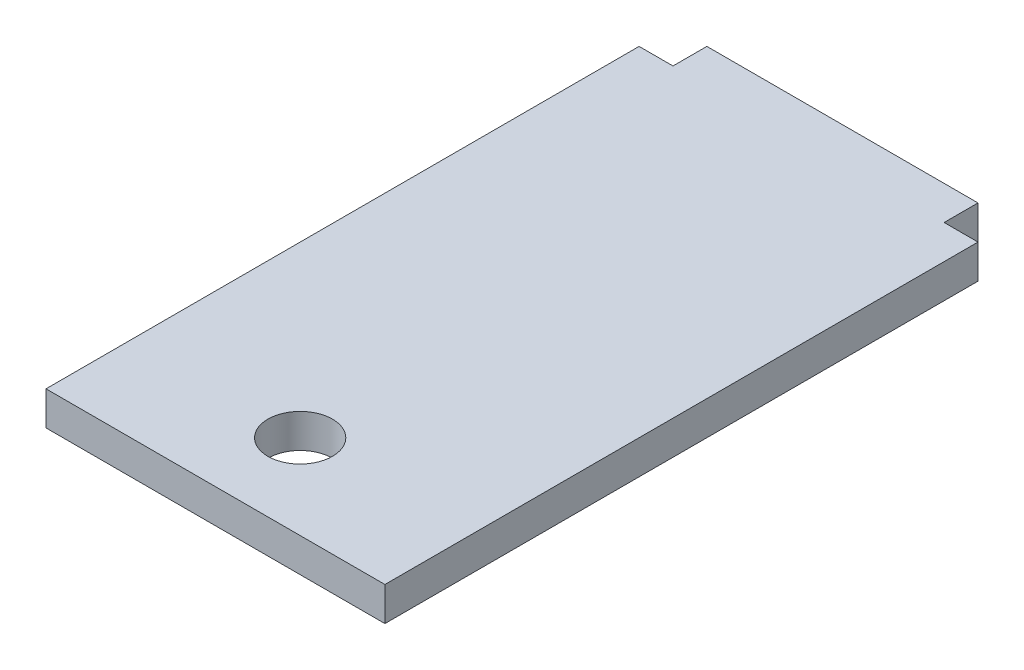
ISO-10303-21;
HEADER;
FILE_DESCRIPTION(('STEP AP214'),'2;1');
FILE_NAME('part.step','',(''),(''),'','','');
FILE_SCHEMA(('AUTOMOTIVE_DESIGN { 1 0 10303 214 1 1 1 1 }'));
ENDSEC;
DATA;
#1=APPLICATION_CONTEXT('core data for automotive mechanical design processes');
#2=APPLICATION_PROTOCOL_DEFINITION('international standard','automotive_design',2000,#1);
#3=PRODUCT_CONTEXT('',#1,'mechanical');
#4=PRODUCT('Part','Part','',(#3));
#5=PRODUCT_RELATED_PRODUCT_CATEGORY('part','',(#4));
#6=PRODUCT_DEFINITION_FORMATION('','',#4);
#7=PRODUCT_DEFINITION_CONTEXT('part definition',#1,'design');
#8=PRODUCT_DEFINITION('design','',#6,#7);
#9=PRODUCT_DEFINITION_SHAPE('','',#8);
#10=(LENGTH_UNIT() NAMED_UNIT(*) SI_UNIT(.MILLI.,.METRE.));
#11=(NAMED_UNIT(*) PLANE_ANGLE_UNIT() SI_UNIT($,.RADIAN.));
#12=(NAMED_UNIT(*) SI_UNIT($,.STERADIAN.) SOLID_ANGLE_UNIT());
#13=UNCERTAINTY_MEASURE_WITH_UNIT(LENGTH_MEASURE(1.E-05),#10,'distance_accuracy_value','');
#14=(GEOMETRIC_REPRESENTATION_CONTEXT(3) GLOBAL_UNCERTAINTY_ASSIGNED_CONTEXT((#13)) GLOBAL_UNIT_ASSIGNED_CONTEXT((#10,
#11,#12)) REPRESENTATION_CONTEXT('',''));
#15=CARTESIAN_POINT('',(0.,0.,0.));
#16=DIRECTION('',(0.,0.,1.));
#17=DIRECTION('',(1.,0.,0.));
#18=AXIS2_PLACEMENT_3D('',#15,#16,#17);
#19=CARTESIAN_POINT('',(0.,5.,0.));
#20=DIRECTION('',(0.,-1.,0.));
#21=DIRECTION('',(0.,0.,-1.));
#22=AXIS2_PLACEMENT_3D('',#19,#20,#21);
#23=PLANE('',#22);
#24=DIRECTION('',(0.,0.,1.));
#25=VECTOR('',#24,1.);
#26=CARTESIAN_POINT('',(0.,5.,0.));
#27=LINE('',#26,#25);
#28=CARTESIAN_POINT('',(0.,5.,-87.5));
#29=VERTEX_POINT('',#28);
#30=CARTESIAN_POINT('',(0.,5.,0.));
#31=VERTEX_POINT('',#30);
#32=EDGE_CURVE('E164',#29,#31,#27,.T.);
#33=ORIENTED_EDGE('',*,*,#32,.T.);
#34=DIRECTION('',(1.,0.,0.));
#35=VECTOR('',#34,1.);
#36=CARTESIAN_POINT('',(0.,5.,0.));
#37=LINE('',#36,#35);
#38=CARTESIAN_POINT('',(50.,5.,0.));
#39=VERTEX_POINT('',#38);
#40=EDGE_CURVE('E100',#31,#39,#37,.T.);
#41=ORIENTED_EDGE('',*,*,#40,.T.);
#42=DIRECTION('',(0.,0.,-1.));
#43=VECTOR('',#42,1.);
#44=CARTESIAN_POINT('',(50.,5.,0.));
#45=LINE('',#44,#43);
#46=CARTESIAN_POINT('',(50.,5.,-87.5));
#47=VERTEX_POINT('',#46);
#48=EDGE_CURVE('E185',#39,#47,#45,.T.);
#49=ORIENTED_EDGE('',*,*,#48,.T.);
#50=DIRECTION('',(-1.,0.,0.));
#51=VECTOR('',#50,1.);
#52=CARTESIAN_POINT('',(50.,5.,-87.5));
#53=LINE('',#52,#51);
#54=CARTESIAN_POINT('',(45.,5.,-87.5));
#55=VERTEX_POINT('',#54);
#56=EDGE_CURVE('E199',#47,#55,#53,.T.);
#57=ORIENTED_EDGE('',*,*,#56,.T.);
#58=DIRECTION('',(0.,0.,-1.));
#59=VECTOR('',#58,1.);
#60=CARTESIAN_POINT('',(45.,5.,-87.5));
#61=LINE('',#60,#59);
#62=CARTESIAN_POINT('',(45.,5.,-92.5));
#63=VERTEX_POINT('',#62);
#64=EDGE_CURVE('E119',#55,#63,#61,.T.);
#65=ORIENTED_EDGE('',*,*,#64,.T.);
#66=DIRECTION('',(-1.,0.,0.));
#67=VECTOR('',#66,1.);
#68=CARTESIAN_POINT('',(5.,5.,-92.5));
#69=LINE('',#68,#67);
#70=CARTESIAN_POINT('',(5.,5.,-92.5));
#71=VERTEX_POINT('',#70);
#72=EDGE_CURVE('E113',#63,#71,#69,.T.);
#73=ORIENTED_EDGE('',*,*,#72,.T.);
#74=DIRECTION('',(0.,0.,1.));
#75=VECTOR('',#74,1.);
#76=CARTESIAN_POINT('',(5.,5.,-92.5));
#77=LINE('',#76,#75);
#78=CARTESIAN_POINT('',(5.,5.,-87.5));
#79=VERTEX_POINT('',#78);
#80=EDGE_CURVE('E117',#71,#79,#77,.T.);
#81=ORIENTED_EDGE('',*,*,#80,.T.);
#82=DIRECTION('',(-1.,0.,0.));
#83=VECTOR('',#82,1.);
#84=CARTESIAN_POINT('',(0.,5.,-87.5));
#85=LINE('',#84,#83);
#86=EDGE_CURVE('E57',#79,#29,#85,.T.);
#87=ORIENTED_EDGE('',*,*,#86,.T.);
#88=EDGE_LOOP('',(#33,#41,#49,#57,#65,#73,#81,#87));
#89=FACE_BOUND('',#88,.T.);
#90=CARTESIAN_POINT('',(25.,5.,-12.5));
#91=DIRECTION('',(0.,1.,0.));
#92=DIRECTION('',(0.,0.,1.));
#93=AXIS2_PLACEMENT_3D('',#90,#91,#92);
#94=CIRCLE('',#93,4.7625);
#95=CARTESIAN_POINT('',(25.,5.,-7.73749999999999));
#96=VERTEX_POINT('',#95);
#97=EDGE_CURVE('E146',#96,#96,#94,.T.);
#98=ORIENTED_EDGE('',*,*,#97,.F.);
#99=EDGE_LOOP('',(#98));
#100=FACE_BOUND('',#99,.T.);
#101=ADVANCED_FACE('F39',(#89,#100),#23,.F.);
#102=CARTESIAN_POINT('',(0.,0.,0.));
#103=DIRECTION('',(0.,-1.,0.));
#104=DIRECTION('',(0.,0.,-1.));
#105=AXIS2_PLACEMENT_3D('',#102,#103,#104);
#106=PLANE('',#105);
#107=DIRECTION('',(0.,0.,1.));
#108=VECTOR('',#107,1.);
#109=CARTESIAN_POINT('',(0.,0.,0.));
#110=LINE('',#109,#108);
#111=CARTESIAN_POINT('',(0.,0.,-87.5));
#112=VERTEX_POINT('',#111);
#113=CARTESIAN_POINT('',(0.,0.,0.));
#114=VERTEX_POINT('',#113);
#115=EDGE_CURVE('E141',#112,#114,#110,.T.);
#116=ORIENTED_EDGE('',*,*,#115,.F.);
#117=DIRECTION('',(-1.,0.,0.));
#118=VECTOR('',#117,1.);
#119=CARTESIAN_POINT('',(0.,0.,-87.5));
#120=LINE('',#119,#118);
#121=CARTESIAN_POINT('',(5.,0.,-87.5));
#122=VERTEX_POINT('',#121);
#123=EDGE_CURVE('E92',#122,#112,#120,.T.);
#124=ORIENTED_EDGE('',*,*,#123,.F.);
#125=DIRECTION('',(0.,0.,1.));
#126=VECTOR('',#125,1.);
#127=CARTESIAN_POINT('',(5.,0.,-92.5));
#128=LINE('',#127,#126);
#129=CARTESIAN_POINT('',(5.,0.,-92.5));
#130=VERTEX_POINT('',#129);
#131=EDGE_CURVE('E86',#130,#122,#128,.T.);
#132=ORIENTED_EDGE('',*,*,#131,.F.);
#133=DIRECTION('',(-1.,0.,0.));
#134=VECTOR('',#133,1.);
#135=CARTESIAN_POINT('',(5.,0.,-92.5));
#136=LINE('',#135,#134);
#137=CARTESIAN_POINT('',(45.,0.,-92.5));
#138=VERTEX_POINT('',#137);
#139=EDGE_CURVE('E128',#138,#130,#136,.T.);
#140=ORIENTED_EDGE('',*,*,#139,.F.);
#141=DIRECTION('',(0.,0.,-1.));
#142=VECTOR('',#141,1.);
#143=CARTESIAN_POINT('',(45.,0.,-87.5));
#144=LINE('',#143,#142);
#145=CARTESIAN_POINT('',(45.,0.,-87.5));
#146=VERTEX_POINT('',#145);
#147=EDGE_CURVE('E155',#146,#138,#144,.T.);
#148=ORIENTED_EDGE('',*,*,#147,.F.);
#149=DIRECTION('',(-1.,0.,0.));
#150=VECTOR('',#149,1.);
#151=CARTESIAN_POINT('',(50.,0.,-87.5));
#152=LINE('',#151,#150);
#153=CARTESIAN_POINT('',(50.,0.,-87.5));
#154=VERTEX_POINT('',#153);
#155=EDGE_CURVE('E152',#154,#146,#152,.T.);
#156=ORIENTED_EDGE('',*,*,#155,.F.);
#157=DIRECTION('',(0.,0.,-1.));
#158=VECTOR('',#157,1.);
#159=CARTESIAN_POINT('',(50.,0.,0.));
#160=LINE('',#159,#158);
#161=CARTESIAN_POINT('',(50.,0.,0.));
#162=VERTEX_POINT('',#161);
#163=EDGE_CURVE('E149',#162,#154,#160,.T.);
#164=ORIENTED_EDGE('',*,*,#163,.F.);
#165=DIRECTION('',(1.,0.,0.));
#166=VECTOR('',#165,1.);
#167=CARTESIAN_POINT('',(0.,0.,0.));
#168=LINE('',#167,#166);
#169=EDGE_CURVE('E145',#114,#162,#168,.T.);
#170=ORIENTED_EDGE('',*,*,#169,.F.);
#171=EDGE_LOOP('',(#116,#124,#132,#140,#148,#156,#164,#170));
#172=FACE_BOUND('',#171,.T.);
#173=CARTESIAN_POINT('',(25.,0.,-12.5));
#174=DIRECTION('',(0.,1.,0.));
#175=DIRECTION('',(0.,0.,1.));
#176=AXIS2_PLACEMENT_3D('',#173,#174,#175);
#177=CIRCLE('',#176,4.7625);
#178=CARTESIAN_POINT('',(25.,0.,-7.73749999999999));
#179=VERTEX_POINT('',#178);
#180=EDGE_CURVE('E209',#179,#179,#177,.T.);
#181=ORIENTED_EDGE('',*,*,#180,.T.);
#182=EDGE_LOOP('',(#181));
#183=FACE_BOUND('',#182,.T.);
#184=ADVANCED_FACE('F189',(#172,#183),#106,.T.);
#185=CARTESIAN_POINT('',(0.,5.,0.));
#186=DIRECTION('',(1.,0.,0.));
#187=DIRECTION('',(0.,0.,-1.));
#188=AXIS2_PLACEMENT_3D('',#185,#186,#187);
#189=PLANE('',#188);
#190=ORIENTED_EDGE('',*,*,#115,.T.);
#191=DIRECTION('',(0.,-1.,0.));
#192=VECTOR('',#191,1.);
#193=CARTESIAN_POINT('',(0.,5.,0.));
#194=LINE('',#193,#192);
#195=EDGE_CURVE('E11',#31,#114,#194,.T.);
#196=ORIENTED_EDGE('',*,*,#195,.F.);
#197=ORIENTED_EDGE('',*,*,#32,.F.);
#198=DIRECTION('',(0.,-1.,0.));
#199=VECTOR('',#198,1.);
#200=CARTESIAN_POINT('',(0.,5.,-87.5));
#201=LINE('',#200,#199);
#202=EDGE_CURVE('E137',#29,#112,#201,.T.);
#203=ORIENTED_EDGE('',*,*,#202,.T.);
#204=EDGE_LOOP('',(#190,#196,#197,#203));
#205=FACE_BOUND('',#204,.T.);
#206=ADVANCED_FACE('F41',(#205),#189,.F.);
#207=CARTESIAN_POINT('',(0.,5.,0.));
#208=DIRECTION('',(0.,0.,-1.));
#209=DIRECTION('',(-1.,0.,0.));
#210=AXIS2_PLACEMENT_3D('',#207,#208,#209);
#211=PLANE('',#210);
#212=ORIENTED_EDGE('',*,*,#169,.T.);
#213=DIRECTION('',(0.,-1.,0.));
#214=VECTOR('',#213,1.);
#215=CARTESIAN_POINT('',(50.,5.,0.));
#216=LINE('',#215,#214);
#217=EDGE_CURVE('E49',#39,#162,#216,.T.);
#218=ORIENTED_EDGE('',*,*,#217,.F.);
#219=ORIENTED_EDGE('',*,*,#40,.F.);
#220=ORIENTED_EDGE('',*,*,#195,.T.);
#221=EDGE_LOOP('',(#212,#218,#219,#220));
#222=FACE_BOUND('',#221,.T.);
#223=ADVANCED_FACE('F239',(#222),#211,.F.);
#224=CARTESIAN_POINT('',(50.,5.,0.));
#225=DIRECTION('',(-1.,0.,0.));
#226=DIRECTION('',(0.,0.,1.));
#227=AXIS2_PLACEMENT_3D('',#224,#225,#226);
#228=PLANE('',#227);
#229=ORIENTED_EDGE('',*,*,#163,.T.);
#230=DIRECTION('',(0.,-1.,0.));
#231=VECTOR('',#230,1.);
#232=CARTESIAN_POINT('',(50.,5.,-87.5));
#233=LINE('',#232,#231);
#234=EDGE_CURVE('E175',#47,#154,#233,.T.);
#235=ORIENTED_EDGE('',*,*,#234,.F.);
#236=ORIENTED_EDGE('',*,*,#48,.F.);
#237=ORIENTED_EDGE('',*,*,#217,.T.);
#238=EDGE_LOOP('',(#229,#235,#236,#237));
#239=FACE_BOUND('',#238,.T.);
#240=ADVANCED_FACE('F183',(#239),#228,.F.);
#241=CARTESIAN_POINT('',(50.,5.,-87.5));
#242=DIRECTION('',(0.,0.,1.));
#243=DIRECTION('',(1.,0.,0.));
#244=AXIS2_PLACEMENT_3D('',#241,#242,#243);
#245=PLANE('',#244);
#246=ORIENTED_EDGE('',*,*,#155,.T.);
#247=DIRECTION('',(0.,-1.,0.));
#248=VECTOR('',#247,1.);
#249=CARTESIAN_POINT('',(45.,5.,-87.5));
#250=LINE('',#249,#248);
#251=EDGE_CURVE('E171',#55,#146,#250,.T.);
#252=ORIENTED_EDGE('',*,*,#251,.F.);
#253=ORIENTED_EDGE('',*,*,#56,.F.);
#254=ORIENTED_EDGE('',*,*,#234,.T.);
#255=EDGE_LOOP('',(#246,#252,#253,#254));
#256=FACE_BOUND('',#255,.T.);
#257=ADVANCED_FACE('F194',(#256),#245,.F.);
#258=CARTESIAN_POINT('',(45.,5.,-87.5));
#259=DIRECTION('',(-1.,0.,0.));
#260=DIRECTION('',(0.,0.,1.));
#261=AXIS2_PLACEMENT_3D('',#258,#259,#260);
#262=PLANE('',#261);
#263=ORIENTED_EDGE('',*,*,#147,.T.);
#264=DIRECTION('',(0.,-1.,0.));
#265=VECTOR('',#264,1.);
#266=CARTESIAN_POINT('',(45.,5.,-92.5));
#267=LINE('',#266,#265);
#268=EDGE_CURVE('E130',#63,#138,#267,.T.);
#269=ORIENTED_EDGE('',*,*,#268,.F.);
#270=ORIENTED_EDGE('',*,*,#64,.F.);
#271=ORIENTED_EDGE('',*,*,#251,.T.);
#272=EDGE_LOOP('',(#263,#269,#270,#271));
#273=FACE_BOUND('',#272,.T.);
#274=ADVANCED_FACE('F197',(#273),#262,.F.);
#275=CARTESIAN_POINT('',(5.,5.,-92.5));
#276=DIRECTION('',(0.,0.,1.));
#277=DIRECTION('',(1.,0.,0.));
#278=AXIS2_PLACEMENT_3D('',#275,#276,#277);
#279=PLANE('',#278);
#280=ORIENTED_EDGE('',*,*,#139,.T.);
#281=DIRECTION('',(0.,-1.,0.));
#282=VECTOR('',#281,1.);
#283=CARTESIAN_POINT('',(5.,5.,-92.5));
#284=LINE('',#283,#282);
#285=EDGE_CURVE('E125',#71,#130,#284,.T.);
#286=ORIENTED_EDGE('',*,*,#285,.F.);
#287=ORIENTED_EDGE('',*,*,#72,.F.);
#288=ORIENTED_EDGE('',*,*,#268,.T.);
#289=EDGE_LOOP('',(#280,#286,#287,#288));
#290=FACE_BOUND('',#289,.T.);
#291=ADVANCED_FACE('F126',(#290),#279,.F.);
#292=CARTESIAN_POINT('',(5.,5.,-92.5));
#293=DIRECTION('',(1.,0.,0.));
#294=DIRECTION('',(0.,0.,-1.));
#295=AXIS2_PLACEMENT_3D('',#292,#293,#294);
#296=PLANE('',#295);
#297=ORIENTED_EDGE('',*,*,#131,.T.);
#298=DIRECTION('',(0.,-1.,0.));
#299=VECTOR('',#298,1.);
#300=CARTESIAN_POINT('',(5.,5.,-87.5));
#301=LINE('',#300,#299);
#302=EDGE_CURVE('E131',#79,#122,#301,.T.);
#303=ORIENTED_EDGE('',*,*,#302,.F.);
#304=ORIENTED_EDGE('',*,*,#80,.F.);
#305=ORIENTED_EDGE('',*,*,#285,.T.);
#306=EDGE_LOOP('',(#297,#303,#304,#305));
#307=FACE_BOUND('',#306,.T.);
#308=ADVANCED_FACE('F133',(#307),#296,.F.);
#309=CARTESIAN_POINT('',(0.,5.,-87.5));
#310=DIRECTION('',(0.,0.,1.));
#311=DIRECTION('',(1.,0.,0.));
#312=AXIS2_PLACEMENT_3D('',#309,#310,#311);
#313=PLANE('',#312);
#314=ORIENTED_EDGE('',*,*,#123,.T.);
#315=ORIENTED_EDGE('',*,*,#202,.F.);
#316=ORIENTED_EDGE('',*,*,#86,.F.);
#317=ORIENTED_EDGE('',*,*,#302,.T.);
#318=EDGE_LOOP('',(#314,#315,#316,#317));
#319=FACE_BOUND('',#318,.T.);
#320=ADVANCED_FACE('F227',(#319),#313,.F.);
#321=CARTESIAN_POINT('',(25.,5.,-12.5));
#322=DIRECTION('',(0.,-1.,0.));
#323=DIRECTION('',(0.,0.,-1.));
#324=AXIS2_PLACEMENT_3D('',#321,#322,#323);
#325=CYLINDRICAL_SURFACE('',#324,4.7625);
#326=ORIENTED_EDGE('',*,*,#97,.T.);
#327=EDGE_LOOP('',(#326));
#328=FACE_BOUND('',#327,.T.);
#329=ORIENTED_EDGE('',*,*,#180,.F.);
#330=EDGE_LOOP('',(#329));
#331=FACE_BOUND('',#330,.T.);
#332=ADVANCED_FACE('F217',(#328,#331),#325,.F.);
#333=CLOSED_SHELL('',(#101,#184,#206,#223,#240,#257,#274,#291,#308,#320,#332));
#334=MANIFOLD_SOLID_BREP('B2',#333);
#335=ADVANCED_BREP_SHAPE_REPRESENTATION('',(#18,#334),#14);
#336=SHAPE_DEFINITION_REPRESENTATION(#9,#335);
ENDSEC;
END-ISO-10303-21;
